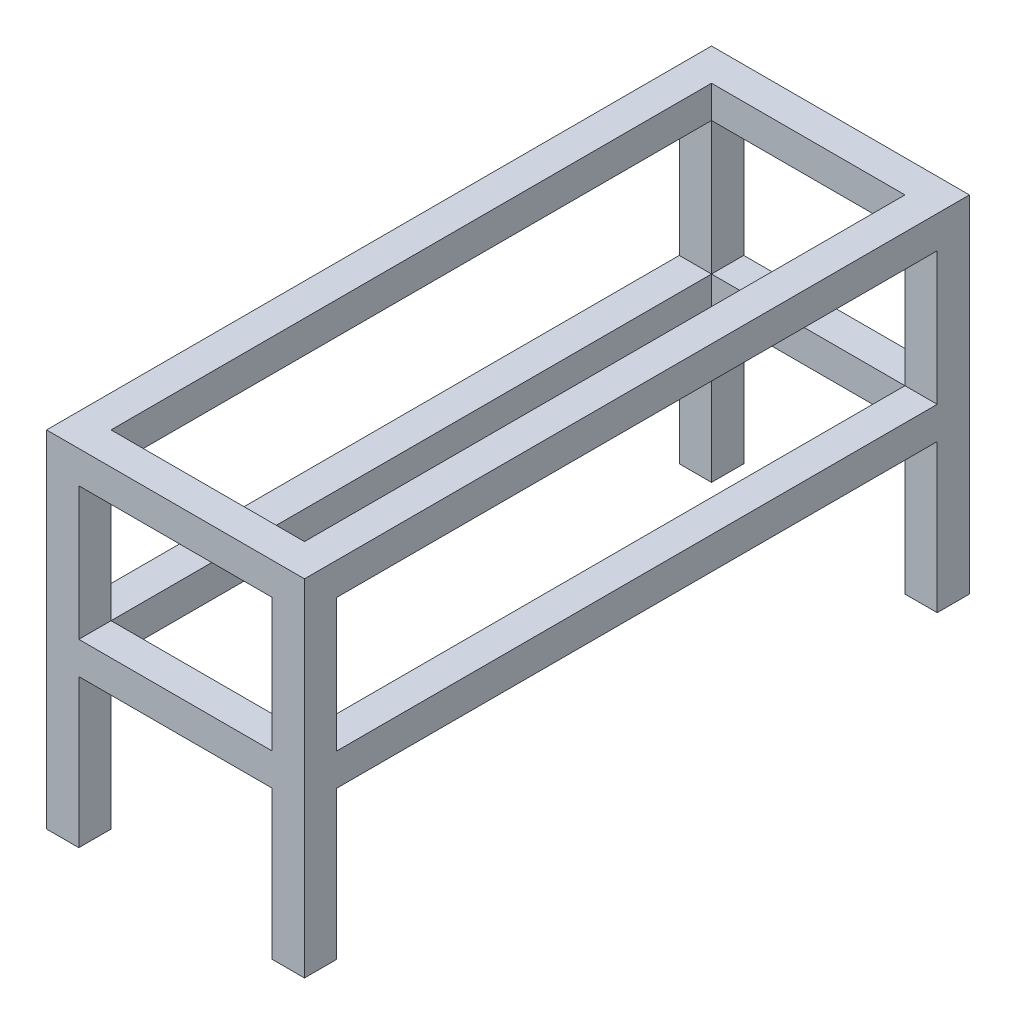
ISO-10303-21;
HEADER;
FILE_DESCRIPTION(('STEP AP214'),'2;1');
FILE_NAME('part.step','',(''),(''),'','','');
FILE_SCHEMA(('AUTOMOTIVE_DESIGN { 1 0 10303 214 1 1 1 1 }'));
ENDSEC;
DATA;
#1=APPLICATION_CONTEXT('core data for automotive mechanical design processes');
#2=APPLICATION_PROTOCOL_DEFINITION('international standard','automotive_design',2000,#1);
#3=PRODUCT_CONTEXT('',#1,'mechanical');
#4=PRODUCT('Part','Part','',(#3));
#5=PRODUCT_RELATED_PRODUCT_CATEGORY('part','',(#4));
#6=PRODUCT_DEFINITION_FORMATION('','',#4);
#7=PRODUCT_DEFINITION_CONTEXT('part definition',#1,'design');
#8=PRODUCT_DEFINITION('design','',#6,#7);
#9=PRODUCT_DEFINITION_SHAPE('','',#8);
#10=(LENGTH_UNIT() NAMED_UNIT(*) SI_UNIT(.MILLI.,.METRE.));
#11=(NAMED_UNIT(*) PLANE_ANGLE_UNIT() SI_UNIT($,.RADIAN.));
#12=(NAMED_UNIT(*) SI_UNIT($,.STERADIAN.) SOLID_ANGLE_UNIT());
#13=UNCERTAINTY_MEASURE_WITH_UNIT(LENGTH_MEASURE(1.E-05),#10,'distance_accuracy_value','');
#14=(GEOMETRIC_REPRESENTATION_CONTEXT(3) GLOBAL_UNCERTAINTY_ASSIGNED_CONTEXT((#13)) GLOBAL_UNIT_ASSIGNED_CONTEXT((#10,
#11,#12)) REPRESENTATION_CONTEXT('',''));
#15=CARTESIAN_POINT('',(0.,0.,0.));
#16=DIRECTION('',(0.,0.,1.));
#17=DIRECTION('',(1.,0.,0.));
#18=AXIS2_PLACEMENT_3D('',#15,#16,#17);
#19=CARTESIAN_POINT('',(0.,0.,-80.));
#20=DIRECTION('',(0.,0.,1.));
#21=DIRECTION('',(1.,0.,0.));
#22=AXIS2_PLACEMENT_3D('',#19,#20,#21);
#23=PLANE('',#22);
#24=DIRECTION('',(-1.,0.,0.));
#25=VECTOR('',#24,1.);
#26=CARTESIAN_POINT('',(80.0000000000001,-490.,-80.));
#27=LINE('',#26,#25);
#28=CARTESIAN_POINT('',(80.0000000000001,-490.,-80.));
#29=VERTEX_POINT('',#28);
#30=CARTESIAN_POINT('',(0.,-490.,-80.));
#31=VERTEX_POINT('',#30);
#32=EDGE_CURVE('E363',#29,#31,#27,.T.);
#33=ORIENTED_EDGE('',*,*,#32,.F.);
#34=DIRECTION('',(0.,1.,0.));
#35=VECTOR('',#34,1.);
#36=CARTESIAN_POINT('',(80.0000000000001,0.,-80.));
#37=LINE('',#36,#35);
#38=CARTESIAN_POINT('',(80.0000000000001,-857.801600000071,-80.));
#39=VERTEX_POINT('',#38);
#40=EDGE_CURVE('E432',#39,#29,#37,.T.);
#41=ORIENTED_EDGE('',*,*,#40,.F.);
#42=DIRECTION('',(1.,0.,0.));
#43=VECTOR('',#42,1.);
#44=CARTESIAN_POINT('',(0.,-857.801600000071,-80.));
#45=LINE('',#44,#43);
#46=CARTESIAN_POINT('',(1.05050398374356E-13,-857.801600000071,-80.));
#47=VERTEX_POINT('',#46);
#48=EDGE_CURVE('E429',#47,#39,#45,.T.);
#49=ORIENTED_EDGE('',*,*,#48,.F.);
#50=DIRECTION('',(0.,-1.,0.));
#51=VECTOR('',#50,1.);
#52=CARTESIAN_POINT('',(0.,0.,-80.));
#53=LINE('',#52,#51);
#54=EDGE_CURVE('E422',#31,#47,#53,.T.);
#55=ORIENTED_EDGE('',*,*,#54,.F.);
#56=EDGE_LOOP('',(#33,#41,#49,#55));
#57=FACE_BOUND('',#56,.T.);
#58=ADVANCED_FACE('F34',(#57),#23,.F.);
#59=DIRECTION('',(0.,-1.,0.));
#60=VECTOR('',#59,1.);
#61=CARTESIAN_POINT('',(80.0000000000001,-490.,-80.));
#62=LINE('',#61,#60);
#63=CARTESIAN_POINT('',(80.0000000000001,-410.,-80.));
#64=VERTEX_POINT('',#63);
#65=EDGE_CURVE('E360',#64,#29,#62,.T.);
#66=ORIENTED_EDGE('',*,*,#65,.F.);
#67=DIRECTION('',(1.,0.,0.));
#68=VECTOR('',#67,1.);
#69=CARTESIAN_POINT('',(0.,-410.,-80.));
#70=LINE('',#69,#68);
#71=CARTESIAN_POINT('',(560.,-410.,-80.));
#72=VERTEX_POINT('',#71);
#73=EDGE_CURVE('E446',#64,#72,#70,.T.);
#74=ORIENTED_EDGE('',*,*,#73,.T.);
#75=DIRECTION('',(0.,1.,0.));
#76=VECTOR('',#75,1.);
#77=CARTESIAN_POINT('',(560.,-410.,-80.));
#78=LINE('',#77,#76);
#79=CARTESIAN_POINT('',(560.,-490.,-80.));
#80=VERTEX_POINT('',#79);
#81=EDGE_CURVE('E375',#80,#72,#78,.T.);
#82=ORIENTED_EDGE('',*,*,#81,.F.);
#83=DIRECTION('',(1.,0.,0.));
#84=VECTOR('',#83,1.);
#85=CARTESIAN_POINT('',(0.,-490.,-80.));
#86=LINE('',#85,#84);
#87=EDGE_CURVE('E435',#29,#80,#86,.T.);
#88=ORIENTED_EDGE('',*,*,#87,.F.);
#89=EDGE_LOOP('',(#66,#74,#82,#88));
#90=FACE_BOUND('',#89,.T.);
#91=ADVANCED_FACE('F547',(#90),#23,.F.);
#92=DIRECTION('',(1.,0.,0.));
#93=VECTOR('',#92,1.);
#94=CARTESIAN_POINT('',(80.0000000000001,-410.,-80.));
#95=LINE('',#94,#93);
#96=CARTESIAN_POINT('',(0.,-410.,-80.));
#97=VERTEX_POINT('',#96);
#98=EDGE_CURVE('E365',#97,#64,#95,.T.);
#99=ORIENTED_EDGE('',*,*,#98,.F.);
#100=CARTESIAN_POINT('',(0.,-80.0000000000001,-80.));
#101=VERTEX_POINT('',#100);
#102=EDGE_CURVE('E426',#101,#97,#53,.T.);
#103=ORIENTED_EDGE('',*,*,#102,.F.);
#104=DIRECTION('',(-1.,0.,0.));
#105=VECTOR('',#104,1.);
#106=CARTESIAN_POINT('',(80.0000000000001,-80.0000000000001,-80.));
#107=LINE('',#106,#105);
#108=CARTESIAN_POINT('',(80.0000000000001,-80.0000000000001,-80.));
#109=VERTEX_POINT('',#108);
#110=EDGE_CURVE('E396',#109,#101,#107,.T.);
#111=ORIENTED_EDGE('',*,*,#110,.F.);
#112=EDGE_CURVE('E436',#64,#109,#37,.T.);
#113=ORIENTED_EDGE('',*,*,#112,.F.);
#114=EDGE_LOOP('',(#99,#103,#111,#113));
#115=FACE_BOUND('',#114,.T.);
#116=ADVANCED_FACE('F535',(#115),#23,.F.);
#117=DIRECTION('',(1.,0.,0.));
#118=VECTOR('',#117,1.);
#119=CARTESIAN_POINT('',(560.,-410.,-80.));
#120=LINE('',#119,#118);
#121=CARTESIAN_POINT('',(640.,-410.,-80.));
#122=VERTEX_POINT('',#121);
#123=EDGE_CURVE('E378',#72,#122,#120,.T.);
#124=ORIENTED_EDGE('',*,*,#123,.F.);
#125=DIRECTION('',(0.,1.,0.));
#126=VECTOR('',#125,1.);
#127=CARTESIAN_POINT('',(560.,0.,-80.));
#128=LINE('',#127,#126);
#129=CARTESIAN_POINT('',(560.,-80.,-80.));
#130=VERTEX_POINT('',#129);
#131=EDGE_CURVE('E443',#72,#130,#128,.T.);
#132=ORIENTED_EDGE('',*,*,#131,.T.);
#133=DIRECTION('',(-1.,0.,0.));
#134=VECTOR('',#133,1.);
#135=CARTESIAN_POINT('',(640.,-80.0000000000001,-80.));
#136=LINE('',#135,#134);
#137=CARTESIAN_POINT('',(640.,-80.0000000000001,-80.));
#138=VERTEX_POINT('',#137);
#139=EDGE_CURVE('E405',#138,#130,#136,.T.);
#140=ORIENTED_EDGE('',*,*,#139,.F.);
#141=DIRECTION('',(0.,-1.,0.));
#142=VECTOR('',#141,1.);
#143=CARTESIAN_POINT('',(640.,0.,-80.));
#144=LINE('',#143,#142);
#145=EDGE_CURVE('E60',#138,#122,#144,.T.);
#146=ORIENTED_EDGE('',*,*,#145,.T.);
#147=EDGE_LOOP('',(#124,#132,#140,#146));
#148=FACE_BOUND('',#147,.T.);
#149=ADVANCED_FACE('F472',(#148),#23,.F.);
#150=DIRECTION('',(-1.,0.,0.));
#151=VECTOR('',#150,1.);
#152=CARTESIAN_POINT('',(560.,-490.,-80.));
#153=LINE('',#152,#151);
#154=CARTESIAN_POINT('',(640.,-490.,-80.));
#155=VERTEX_POINT('',#154);
#156=EDGE_CURVE('E380',#155,#80,#153,.T.);
#157=ORIENTED_EDGE('',*,*,#156,.F.);
#158=CARTESIAN_POINT('',(640.,-857.801600000071,-80.));
#159=VERTEX_POINT('',#158);
#160=EDGE_CURVE('E38',#155,#159,#144,.T.);
#161=ORIENTED_EDGE('',*,*,#160,.T.);
#162=DIRECTION('',(-1.,0.,0.));
#163=VECTOR('',#162,1.);
#164=CARTESIAN_POINT('',(0.,-857.801600000071,-80.));
#165=LINE('',#164,#163);
#166=CARTESIAN_POINT('',(560.,-857.801600000071,-80.));
#167=VERTEX_POINT('',#166);
#168=EDGE_CURVE('E442',#159,#167,#165,.T.);
#169=ORIENTED_EDGE('',*,*,#168,.T.);
#170=EDGE_CURVE('E439',#167,#80,#128,.T.);
#171=ORIENTED_EDGE('',*,*,#170,.T.);
#172=EDGE_LOOP('',(#157,#161,#169,#171));
#173=FACE_BOUND('',#172,.T.);
#174=ADVANCED_FACE('F639',(#173),#23,.F.);
#175=DIRECTION('',(0.,-1.,0.));
#176=VECTOR('',#175,1.);
#177=CARTESIAN_POINT('',(80.0000000000001,-80.0000000000001,-80.));
#178=LINE('',#177,#176);
#179=CARTESIAN_POINT('',(80.0000000000001,0.,-80.));
#180=VERTEX_POINT('',#179);
#181=EDGE_CURVE('E393',#180,#109,#178,.T.);
#182=ORIENTED_EDGE('',*,*,#181,.F.);
#183=DIRECTION('',(1.,0.,0.));
#184=VECTOR('',#183,1.);
#185=CARTESIAN_POINT('',(0.,0.,-80.));
#186=LINE('',#185,#184);
#187=CARTESIAN_POINT('',(560.,0.,-80.));
#188=VERTEX_POINT('',#187);
#189=EDGE_CURVE('E421',#180,#188,#186,.T.);
#190=ORIENTED_EDGE('',*,*,#189,.T.);
#191=DIRECTION('',(0.,1.,0.));
#192=VECTOR('',#191,1.);
#193=CARTESIAN_POINT('',(560.,0.,-80.));
#194=LINE('',#193,#192);
#195=EDGE_CURVE('E411',#130,#188,#194,.T.);
#196=ORIENTED_EDGE('',*,*,#195,.F.);
#197=DIRECTION('',(-1.,0.,0.));
#198=VECTOR('',#197,1.);
#199=CARTESIAN_POINT('',(0.,-80.0000000000001,-80.));
#200=LINE('',#199,#198);
#201=EDGE_CURVE('E563',#130,#109,#200,.T.);
#202=ORIENTED_EDGE('',*,*,#201,.T.);
#203=EDGE_LOOP('',(#182,#190,#196,#202));
#204=FACE_BOUND('',#203,.T.);
#205=ADVANCED_FACE('F632',(#204),#23,.F.);
#206=CARTESIAN_POINT('',(0.,-410.,-80.));
#207=DIRECTION('',(0.,-1.,0.));
#208=DIRECTION('',(1.,0.,0.));
#209=AXIS2_PLACEMENT_3D('',#206,#207,#208);
#210=PLANE('',#209);
#211=DIRECTION('',(1.,0.,0.));
#212=VECTOR('',#211,1.);
#213=CARTESIAN_POINT('',(0.,-410.,0.));
#214=LINE('',#213,#212);
#215=CARTESIAN_POINT('',(80.0000000000001,-410.,0.));
#216=VERTEX_POINT('',#215);
#217=CARTESIAN_POINT('',(560.,-410.,0.));
#218=VERTEX_POINT('',#217);
#219=EDGE_CURVE('E586',#216,#218,#214,.T.);
#220=ORIENTED_EDGE('',*,*,#219,.T.);
#221=DIRECTION('',(0.,0.,1.));
#222=VECTOR('',#221,1.);
#223=CARTESIAN_POINT('',(560.,-410.,-80.));
#224=LINE('',#223,#222);
#225=EDGE_CURVE('E11',#72,#218,#224,.T.);
#226=ORIENTED_EDGE('',*,*,#225,.F.);
#227=ORIENTED_EDGE('',*,*,#73,.F.);
#228=DIRECTION('',(0.,0.,1.));
#229=VECTOR('',#228,1.);
#230=CARTESIAN_POINT('',(80.0000000000001,-410.,-80.));
#231=LINE('',#230,#229);
#232=EDGE_CURVE('E552',#64,#216,#231,.T.);
#233=ORIENTED_EDGE('',*,*,#232,.T.);
#234=EDGE_LOOP('',(#220,#226,#227,#233));
#235=FACE_BOUND('',#234,.T.);
#236=ADVANCED_FACE('F562',(#235),#210,.F.);
#237=CARTESIAN_POINT('',(560.,0.,-80.));
#238=DIRECTION('',(1.,0.,0.));
#239=DIRECTION('',(0.,0.,-1.));
#240=AXIS2_PLACEMENT_3D('',#237,#238,#239);
#241=PLANE('',#240);
#242=DIRECTION('',(0.,1.,0.));
#243=VECTOR('',#242,1.);
#244=CARTESIAN_POINT('',(560.,0.,0.));
#245=LINE('',#244,#243);
#246=CARTESIAN_POINT('',(560.,-80.,0.));
#247=VERTEX_POINT('',#246);
#248=EDGE_CURVE('E423',#218,#247,#245,.T.);
#249=ORIENTED_EDGE('',*,*,#248,.T.);
#250=DIRECTION('',(0.,0.,1.));
#251=VECTOR('',#250,1.);
#252=CARTESIAN_POINT('',(560.,-80.,-80.));
#253=LINE('',#252,#251);
#254=EDGE_CURVE('E44',#130,#247,#253,.T.);
#255=ORIENTED_EDGE('',*,*,#254,.F.);
#256=ORIENTED_EDGE('',*,*,#131,.F.);
#257=ORIENTED_EDGE('',*,*,#225,.T.);
#258=EDGE_LOOP('',(#249,#255,#256,#257));
#259=FACE_BOUND('',#258,.T.);
#260=ADVANCED_FACE('F644',(#259),#241,.F.);
#261=CARTESIAN_POINT('',(0.,-80.0000000000001,-80.));
#262=DIRECTION('',(0.,1.,0.));
#263=DIRECTION('',(-1.,0.,0.));
#264=AXIS2_PLACEMENT_3D('',#261,#262,#263);
#265=PLANE('',#264);
#266=DIRECTION('',(-1.,0.,0.));
#267=VECTOR('',#266,1.);
#268=CARTESIAN_POINT('',(0.,-80.0000000000001,0.));
#269=LINE('',#268,#267);
#270=CARTESIAN_POINT('',(80.0000000000001,-80.0000000000001,0.));
#271=VERTEX_POINT('',#270);
#272=EDGE_CURVE('E588',#247,#271,#269,.T.);
#273=ORIENTED_EDGE('',*,*,#272,.T.);
#274=DIRECTION('',(0.,0.,1.));
#275=VECTOR('',#274,1.);
#276=CARTESIAN_POINT('',(80.0000000000001,-80.0000000000001,-80.));
#277=LINE('',#276,#275);
#278=EDGE_CURVE('E559',#109,#271,#277,.T.);
#279=ORIENTED_EDGE('',*,*,#278,.F.);
#280=ORIENTED_EDGE('',*,*,#201,.F.);
#281=ORIENTED_EDGE('',*,*,#254,.T.);
#282=EDGE_LOOP('',(#273,#279,#280,#281));
#283=FACE_BOUND('',#282,.T.);
#284=ADVANCED_FACE('F672',(#283),#265,.F.);
#285=CARTESIAN_POINT('',(0.,0.,-80.));
#286=DIRECTION('',(0.,-1.,0.));
#287=DIRECTION('',(0.,0.,-1.));
#288=AXIS2_PLACEMENT_3D('',#285,#286,#287);
#289=PLANE('',#288);
#290=DIRECTION('',(0.,0.,1.));
#291=VECTOR('',#290,1.);
#292=CARTESIAN_POINT('',(640.,0.,-80.));
#293=LINE('',#292,#291);
#294=CARTESIAN_POINT('',(640.,0.,-1650.));
#295=VERTEX_POINT('',#294);
#296=CARTESIAN_POINT('',(640.,0.,0.));
#297=VERTEX_POINT('',#296);
#298=EDGE_CURVE('E560',#295,#297,#293,.T.);
#299=ORIENTED_EDGE('',*,*,#298,.F.);
#300=DIRECTION('',(1.,0.,0.));
#301=VECTOR('',#300,1.);
#302=CARTESIAN_POINT('',(0.,0.,-1650.));
#303=LINE('',#302,#301);
#304=CARTESIAN_POINT('',(0.,0.,-1650.));
#305=VERTEX_POINT('',#304);
#306=EDGE_CURVE('E285',#305,#295,#303,.T.);
#307=ORIENTED_EDGE('',*,*,#306,.F.);
#308=DIRECTION('',(0.,0.,1.));
#309=VECTOR('',#308,1.);
#310=CARTESIAN_POINT('',(0.,0.,-80.));
#311=LINE('',#310,#309);
#312=CARTESIAN_POINT('',(0.,0.,0.));
#313=VERTEX_POINT('',#312);
#314=EDGE_CURVE('E452',#305,#313,#311,.T.);
#315=ORIENTED_EDGE('',*,*,#314,.T.);
#316=DIRECTION('',(1.,0.,0.));
#317=VECTOR('',#316,1.);
#318=CARTESIAN_POINT('',(0.,0.,0.));
#319=LINE('',#318,#317);
#320=EDGE_CURVE('E459',#313,#297,#319,.T.);
#321=ORIENTED_EDGE('',*,*,#320,.T.);
#322=EDGE_LOOP('',(#299,#307,#315,#321));
#323=FACE_BOUND('',#322,.T.);
#324=DIRECTION('',(1.,0.,0.));
#325=VECTOR('',#324,1.);
#326=CARTESIAN_POINT('',(0.,0.,-1570.));
#327=LINE('',#326,#325);
#328=CARTESIAN_POINT('',(80.0000000000001,0.,-1570.));
#329=VERTEX_POINT('',#328);
#330=CARTESIAN_POINT('',(560.,0.,-1570.));
#331=VERTEX_POINT('',#330);
#332=EDGE_CURVE('E246',#329,#331,#327,.T.);
#333=ORIENTED_EDGE('',*,*,#332,.T.);
#334=DIRECTION('',(0.,0.,1.));
#335=VECTOR('',#334,1.);
#336=CARTESIAN_POINT('',(560.,0.,-825.));
#337=LINE('',#336,#335);
#338=EDGE_CURVE('E415',#331,#188,#337,.T.);
#339=ORIENTED_EDGE('',*,*,#338,.T.);
#340=ORIENTED_EDGE('',*,*,#189,.F.);
#341=DIRECTION('',(0.,0.,1.));
#342=VECTOR('',#341,1.);
#343=CARTESIAN_POINT('',(80.0000000000001,0.,-825.));
#344=LINE('',#343,#342);
#345=EDGE_CURVE('E399',#329,#180,#344,.T.);
#346=ORIENTED_EDGE('',*,*,#345,.F.);
#347=EDGE_LOOP('',(#333,#339,#340,#346));
#348=FACE_BOUND('',#347,.T.);
#349=ADVANCED_FACE('F36',(#323,#348),#289,.F.);
#350=CARTESIAN_POINT('',(640.,0.,-80.));
#351=DIRECTION('',(-1.,0.,0.));
#352=DIRECTION('',(0.,0.,1.));
#353=AXIS2_PLACEMENT_3D('',#350,#351,#352);
#354=PLANE('',#353);
#355=DIRECTION('',(0.,0.,1.));
#356=VECTOR('',#355,1.);
#357=CARTESIAN_POINT('',(640.,-80.0000000000001,-825.));
#358=LINE('',#357,#356);
#359=CARTESIAN_POINT('',(640.,-80.0000000000001,-1570.));
#360=VERTEX_POINT('',#359);
#361=EDGE_CURVE('E457',#360,#138,#358,.T.);
#362=ORIENTED_EDGE('',*,*,#361,.F.);
#363=DIRECTION('',(0.,-1.,0.));
#364=VECTOR('',#363,1.);
#365=CARTESIAN_POINT('',(640.,0.,-1570.));
#366=LINE('',#365,#364);
#367=CARTESIAN_POINT('',(640.,-410.,-1570.));
#368=VERTEX_POINT('',#367);
#369=EDGE_CURVE('E245',#360,#368,#366,.T.);
#370=ORIENTED_EDGE('',*,*,#369,.T.);
#371=DIRECTION('',(0.,0.,1.));
#372=VECTOR('',#371,1.);
#373=CARTESIAN_POINT('',(640.,-410.,-825.));
#374=LINE('',#373,#372);
#375=EDGE_CURVE('E387',#368,#122,#374,.T.);
#376=ORIENTED_EDGE('',*,*,#375,.T.);
#377=ORIENTED_EDGE('',*,*,#145,.F.);
#378=EDGE_LOOP('',(#362,#370,#376,#377));
#379=FACE_BOUND('',#378,.T.);
#380=DIRECTION('',(0.,-1.,0.));
#381=VECTOR('',#380,1.);
#382=CARTESIAN_POINT('',(640.,0.,0.));
#383=LINE('',#382,#381);
#384=CARTESIAN_POINT('',(640.,-857.801600000071,0.));
#385=VERTEX_POINT('',#384);
#386=EDGE_CURVE('E584',#297,#385,#383,.T.);
#387=ORIENTED_EDGE('',*,*,#386,.T.);
#388=DIRECTION('',(0.,0.,1.));
#389=VECTOR('',#388,1.);
#390=CARTESIAN_POINT('',(640.,-857.801600000071,-80.));
#391=LINE('',#390,#389);
#392=EDGE_CURVE('E596',#159,#385,#391,.T.);
#393=ORIENTED_EDGE('',*,*,#392,.F.);
#394=ORIENTED_EDGE('',*,*,#160,.F.);
#395=DIRECTION('',(0.,0.,1.));
#396=VECTOR('',#395,1.);
#397=CARTESIAN_POINT('',(640.,-490.,-825.));
#398=LINE('',#397,#396);
#399=CARTESIAN_POINT('',(640.,-490.,-1570.));
#400=VERTEX_POINT('',#399);
#401=EDGE_CURVE('E241',#400,#155,#398,.T.);
#402=ORIENTED_EDGE('',*,*,#401,.F.);
#403=CARTESIAN_POINT('',(640.,-857.801600000071,-1570.));
#404=VERTEX_POINT('',#403);
#405=EDGE_CURVE('E234',#400,#404,#366,.T.);
#406=ORIENTED_EDGE('',*,*,#405,.T.);
#407=DIRECTION('',(0.,0.,-1.));
#408=VECTOR('',#407,1.);
#409=CARTESIAN_POINT('',(640.,-857.801600000071,-1570.));
#410=LINE('',#409,#408);
#411=CARTESIAN_POINT('',(640.,-857.801600000071,-1650.));
#412=VERTEX_POINT('',#411);
#413=EDGE_CURVE('E238',#404,#412,#410,.T.);
#414=ORIENTED_EDGE('',*,*,#413,.T.);
#415=DIRECTION('',(0.,-1.,0.));
#416=VECTOR('',#415,1.);
#417=CARTESIAN_POINT('',(640.,0.,-1650.));
#418=LINE('',#417,#416);
#419=EDGE_CURVE('E288',#295,#412,#418,.T.);
#420=ORIENTED_EDGE('',*,*,#419,.F.);
#421=ORIENTED_EDGE('',*,*,#298,.T.);
#422=EDGE_LOOP('',(#387,#393,#394,#402,#406,#414,#420,#421));
#423=FACE_BOUND('',#422,.T.);
#424=ADVANCED_FACE('F236',(#379,#423),#354,.F.);
#425=CARTESIAN_POINT('',(0.,-857.801600000071,-80.));
#426=DIRECTION('',(0.,1.,0.));
#427=DIRECTION('',(0.,0.,1.));
#428=AXIS2_PLACEMENT_3D('',#425,#426,#427);
#429=PLANE('',#428);
#430=DIRECTION('',(-1.,0.,0.));
#431=VECTOR('',#430,1.);
#432=CARTESIAN_POINT('',(0.,-857.801600000071,0.));
#433=LINE('',#432,#431);
#434=CARTESIAN_POINT('',(560.,-857.801600000071,0.));
#435=VERTEX_POINT('',#434);
#436=EDGE_CURVE('E582',#385,#435,#433,.T.);
#437=ORIENTED_EDGE('',*,*,#436,.T.);
#438=DIRECTION('',(0.,0.,1.));
#439=VECTOR('',#438,1.);
#440=CARTESIAN_POINT('',(560.,-857.801600000071,-80.));
#441=LINE('',#440,#439);
#442=EDGE_CURVE('E599',#167,#435,#441,.T.);
#443=ORIENTED_EDGE('',*,*,#442,.F.);
#444=ORIENTED_EDGE('',*,*,#168,.F.);
#445=ORIENTED_EDGE('',*,*,#392,.T.);
#446=EDGE_LOOP('',(#437,#443,#444,#445));
#447=FACE_BOUND('',#446,.T.);
#448=ADVANCED_FACE('F680',(#447),#429,.F.);
#449=CARTESIAN_POINT('',(560.,-490.,0.));
#450=VERTEX_POINT('',#449);
#451=EDGE_CURVE('E579',#435,#450,#245,.T.);
#452=ORIENTED_EDGE('',*,*,#451,.T.);
#453=DIRECTION('',(0.,0.,1.));
#454=VECTOR('',#453,1.);
#455=CARTESIAN_POINT('',(560.,-490.,-80.));
#456=LINE('',#455,#454);
#457=EDGE_CURVE('E602',#80,#450,#456,.T.);
#458=ORIENTED_EDGE('',*,*,#457,.F.);
#459=ORIENTED_EDGE('',*,*,#170,.F.);
#460=ORIENTED_EDGE('',*,*,#442,.T.);
#461=EDGE_LOOP('',(#452,#458,#459,#460));
#462=FACE_BOUND('',#461,.T.);
#463=ADVANCED_FACE('F674',(#462),#241,.F.);
#464=CARTESIAN_POINT('',(0.,-490.,-80.));
#465=DIRECTION('',(0.,-1.,0.));
#466=DIRECTION('',(1.,0.,0.));
#467=AXIS2_PLACEMENT_3D('',#464,#465,#466);
#468=PLANE('',#467);
#469=DIRECTION('',(1.,0.,0.));
#470=VECTOR('',#469,1.);
#471=CARTESIAN_POINT('',(0.,-490.,0.));
#472=LINE('',#471,#470);
#473=CARTESIAN_POINT('',(80.0000000000001,-490.,0.));
#474=VERTEX_POINT('',#473);
#475=EDGE_CURVE('E576',#474,#450,#472,.T.);
#476=ORIENTED_EDGE('',*,*,#475,.F.);
#477=DIRECTION('',(0.,0.,1.));
#478=VECTOR('',#477,1.);
#479=CARTESIAN_POINT('',(80.0000000000001,-490.,-80.));
#480=LINE('',#479,#478);
#481=EDGE_CURVE('E604',#29,#474,#480,.T.);
#482=ORIENTED_EDGE('',*,*,#481,.F.);
#483=ORIENTED_EDGE('',*,*,#87,.T.);
#484=ORIENTED_EDGE('',*,*,#457,.T.);
#485=EDGE_LOOP('',(#476,#482,#483,#484));
#486=FACE_BOUND('',#485,.T.);
#487=ADVANCED_FACE('F684',(#486),#468,.T.);
#488=CARTESIAN_POINT('',(80.0000000000001,0.,-80.));
#489=DIRECTION('',(1.,0.,0.));
#490=DIRECTION('',(0.,0.,-1.));
#491=AXIS2_PLACEMENT_3D('',#488,#489,#490);
#492=PLANE('',#491);
#493=DIRECTION('',(0.,1.,0.));
#494=VECTOR('',#493,1.);
#495=CARTESIAN_POINT('',(80.0000000000001,0.,0.));
#496=LINE('',#495,#494);
#497=CARTESIAN_POINT('',(80.0000000000001,-857.801600000071,0.));
#498=VERTEX_POINT('',#497);
#499=EDGE_CURVE('E573',#498,#474,#496,.T.);
#500=ORIENTED_EDGE('',*,*,#499,.F.);
#501=DIRECTION('',(0.,0.,1.));
#502=VECTOR('',#501,1.);
#503=CARTESIAN_POINT('',(80.0000000000001,-857.801600000071,-80.));
#504=LINE('',#503,#502);
#505=EDGE_CURVE('E606',#39,#498,#504,.T.);
#506=ORIENTED_EDGE('',*,*,#505,.F.);
#507=ORIENTED_EDGE('',*,*,#40,.T.);
#508=ORIENTED_EDGE('',*,*,#481,.T.);
#509=EDGE_LOOP('',(#500,#506,#507,#508));
#510=FACE_BOUND('',#509,.T.);
#511=ADVANCED_FACE('F626',(#510),#492,.T.);
#512=CARTESIAN_POINT('',(0.,-857.801600000071,-80.));
#513=DIRECTION('',(0.,-1.,0.));
#514=DIRECTION('',(0.,0.,-1.));
#515=AXIS2_PLACEMENT_3D('',#512,#513,#514);
#516=PLANE('',#515);
#517=DIRECTION('',(1.,0.,0.));
#518=VECTOR('',#517,1.);
#519=CARTESIAN_POINT('',(0.,-857.801600000071,0.));
#520=LINE('',#519,#518);
#521=CARTESIAN_POINT('',(1.05050398374356E-13,-857.801600000071,0.));
#522=VERTEX_POINT('',#521);
#523=EDGE_CURVE('E570',#522,#498,#520,.T.);
#524=ORIENTED_EDGE('',*,*,#523,.F.);
#525=DIRECTION('',(0.,0.,1.));
#526=VECTOR('',#525,1.);
#527=CARTESIAN_POINT('',(1.05050398374356E-13,-857.801600000071,-80.));
#528=LINE('',#527,#526);
#529=EDGE_CURVE('E607',#47,#522,#528,.T.);
#530=ORIENTED_EDGE('',*,*,#529,.F.);
#531=ORIENTED_EDGE('',*,*,#48,.T.);
#532=ORIENTED_EDGE('',*,*,#505,.T.);
#533=EDGE_LOOP('',(#524,#530,#531,#532));
#534=FACE_BOUND('',#533,.T.);
#535=ADVANCED_FACE('F620',(#534),#516,.T.);
#536=CARTESIAN_POINT('',(0.,0.,-80.));
#537=DIRECTION('',(-1.,0.,0.));
#538=DIRECTION('',(0.,-1.,0.));
#539=AXIS2_PLACEMENT_3D('',#536,#537,#538);
#540=PLANE('',#539);
#541=ORIENTED_EDGE('',*,*,#314,.F.);
#542=DIRECTION('',(0.,-1.,0.));
#543=VECTOR('',#542,1.);
#544=CARTESIAN_POINT('',(0.,0.,-1650.));
#545=LINE('',#544,#543);
#546=CARTESIAN_POINT('',(1.05050398374356E-13,-857.801600000071,-1650.));
#547=VERTEX_POINT('',#546);
#548=EDGE_CURVE('E303',#305,#547,#545,.T.);
#549=ORIENTED_EDGE('',*,*,#548,.T.);
#550=DIRECTION('',(0.,0.,-1.));
#551=VECTOR('',#550,1.);
#552=CARTESIAN_POINT('',(1.05050398374356E-13,-857.801600000071,-1570.));
#553=LINE('',#552,#551);
#554=CARTESIAN_POINT('',(1.05050398374356E-13,-857.801600000071,-1570.));
#555=VERTEX_POINT('',#554);
#556=EDGE_CURVE('E320',#555,#547,#553,.T.);
#557=ORIENTED_EDGE('',*,*,#556,.F.);
#558=DIRECTION('',(0.,-1.,0.));
#559=VECTOR('',#558,1.);
#560=CARTESIAN_POINT('',(0.,0.,-1570.));
#561=LINE('',#560,#559);
#562=CARTESIAN_POINT('',(0.,-490.,-1570.));
#563=VERTEX_POINT('',#562);
#564=EDGE_CURVE('E276',#563,#555,#561,.T.);
#565=ORIENTED_EDGE('',*,*,#564,.F.);
#566=DIRECTION('',(0.,0.,1.));
#567=VECTOR('',#566,1.);
#568=CARTESIAN_POINT('',(0.,-490.,-825.));
#569=LINE('',#568,#567);
#570=EDGE_CURVE('E52',#563,#31,#569,.T.);
#571=ORIENTED_EDGE('',*,*,#570,.T.);
#572=ORIENTED_EDGE('',*,*,#54,.T.);
#573=ORIENTED_EDGE('',*,*,#529,.T.);
#574=DIRECTION('',(0.,-1.,0.));
#575=VECTOR('',#574,1.);
#576=CARTESIAN_POINT('',(0.,0.,0.));
#577=LINE('',#576,#575);
#578=EDGE_CURVE('E463',#313,#522,#577,.T.);
#579=ORIENTED_EDGE('',*,*,#578,.F.);
#580=EDGE_LOOP('',(#541,#549,#557,#565,#571,#572,#573,#579));
#581=FACE_BOUND('',#580,.T.);
#582=CARTESIAN_POINT('',(0.,-80.0000000000001,-1570.));
#583=VERTEX_POINT('',#582);
#584=CARTESIAN_POINT('',(0.,-410.,-1570.));
#585=VERTEX_POINT('',#584);
#586=EDGE_CURVE('E278',#583,#585,#561,.T.);
#587=ORIENTED_EDGE('',*,*,#586,.F.);
#588=DIRECTION('',(0.,0.,1.));
#589=VECTOR('',#588,1.);
#590=CARTESIAN_POINT('',(0.,-80.0000000000001,-825.));
#591=LINE('',#590,#589);
#592=EDGE_CURVE('E401',#583,#101,#591,.T.);
#593=ORIENTED_EDGE('',*,*,#592,.T.);
#594=ORIENTED_EDGE('',*,*,#102,.T.);
#595=DIRECTION('',(0.,0.,1.));
#596=VECTOR('',#595,1.);
#597=CARTESIAN_POINT('',(0.,-410.,-825.));
#598=LINE('',#597,#596);
#599=EDGE_CURVE('E370',#585,#97,#598,.T.);
#600=ORIENTED_EDGE('',*,*,#599,.F.);
#601=EDGE_LOOP('',(#587,#593,#594,#600));
#602=FACE_BOUND('',#601,.T.);
#603=ADVANCED_FACE('F531',(#581,#602),#540,.T.);
#604=EDGE_CURVE('E555',#216,#271,#496,.T.);
#605=ORIENTED_EDGE('',*,*,#604,.F.);
#606=ORIENTED_EDGE('',*,*,#232,.F.);
#607=ORIENTED_EDGE('',*,*,#112,.T.);
#608=ORIENTED_EDGE('',*,*,#278,.T.);
#609=EDGE_LOOP('',(#605,#606,#607,#608));
#610=FACE_BOUND('',#609,.T.);
#611=ADVANCED_FACE('F553',(#610),#492,.T.);
#612=CARTESIAN_POINT('',(0.,0.,0.));
#613=DIRECTION('',(0.,0.,1.));
#614=DIRECTION('',(1.,0.,0.));
#615=AXIS2_PLACEMENT_3D('',#612,#613,#614);
#616=PLANE('',#615);
#617=ORIENTED_EDGE('',*,*,#320,.F.);
#618=ORIENTED_EDGE('',*,*,#578,.T.);
#619=ORIENTED_EDGE('',*,*,#523,.T.);
#620=ORIENTED_EDGE('',*,*,#499,.T.);
#621=ORIENTED_EDGE('',*,*,#475,.T.);
#622=ORIENTED_EDGE('',*,*,#451,.F.);
#623=ORIENTED_EDGE('',*,*,#436,.F.);
#624=ORIENTED_EDGE('',*,*,#386,.F.);
#625=EDGE_LOOP('',(#617,#618,#619,#620,#621,#622,#623,#624));
#626=FACE_BOUND('',#625,.T.);
#627=ORIENTED_EDGE('',*,*,#219,.F.);
#628=ORIENTED_EDGE('',*,*,#604,.T.);
#629=ORIENTED_EDGE('',*,*,#272,.F.);
#630=ORIENTED_EDGE('',*,*,#248,.F.);
#631=EDGE_LOOP('',(#627,#628,#629,#630));
#632=FACE_BOUND('',#631,.T.);
#633=ADVANCED_FACE('F616',(#626,#632),#616,.T.);
#634=CARTESIAN_POINT('',(640.,-80.0000000000001,-825.));
#635=DIRECTION('',(0.,1.,0.));
#636=DIRECTION('',(-1.,0.,0.));
#637=AXIS2_PLACEMENT_3D('',#634,#635,#636);
#638=PLANE('',#637);
#639=ORIENTED_EDGE('',*,*,#139,.T.);
#640=DIRECTION('',(0.,0.,1.));
#641=VECTOR('',#640,1.);
#642=CARTESIAN_POINT('',(560.,-80.,-825.));
#643=LINE('',#642,#641);
#644=CARTESIAN_POINT('',(560.,-80.,-1570.));
#645=VERTEX_POINT('',#644);
#646=EDGE_CURVE('E408',#645,#130,#643,.T.);
#647=ORIENTED_EDGE('',*,*,#646,.F.);
#648=DIRECTION('',(-1.,0.,0.));
#649=VECTOR('',#648,1.);
#650=CARTESIAN_POINT('',(640.,-80.0000000000001,-1570.));
#651=LINE('',#650,#649);
#652=EDGE_CURVE('E357',#360,#645,#651,.T.);
#653=ORIENTED_EDGE('',*,*,#652,.F.);
#654=ORIENTED_EDGE('',*,*,#361,.T.);
#655=EDGE_LOOP('',(#639,#647,#653,#654));
#656=FACE_BOUND('',#655,.T.);
#657=ADVANCED_FACE('F470',(#656),#638,.F.);
#658=CARTESIAN_POINT('',(560.,0.,-825.));
#659=DIRECTION('',(1.,0.,0.));
#660=DIRECTION('',(0.,0.,-1.));
#661=AXIS2_PLACEMENT_3D('',#658,#659,#660);
#662=PLANE('',#661);
#663=ORIENTED_EDGE('',*,*,#195,.T.);
#664=ORIENTED_EDGE('',*,*,#338,.F.);
#665=DIRECTION('',(0.,1.,0.));
#666=VECTOR('',#665,1.);
#667=CARTESIAN_POINT('',(560.,0.,-1570.));
#668=LINE('',#667,#666);
#669=EDGE_CURVE('E354',#645,#331,#668,.T.);
#670=ORIENTED_EDGE('',*,*,#669,.F.);
#671=ORIENTED_EDGE('',*,*,#646,.T.);
#672=EDGE_LOOP('',(#663,#664,#670,#671));
#673=FACE_BOUND('',#672,.T.);
#674=ADVANCED_FACE('F468',(#673),#662,.F.);
#675=CARTESIAN_POINT('',(80.0000000000001,-80.0000000000001,-825.));
#676=DIRECTION('',(-1.,0.,0.));
#677=DIRECTION('',(0.,0.,1.));
#678=AXIS2_PLACEMENT_3D('',#675,#676,#677);
#679=PLANE('',#678);
#680=ORIENTED_EDGE('',*,*,#181,.T.);
#681=DIRECTION('',(0.,0.,1.));
#682=VECTOR('',#681,1.);
#683=CARTESIAN_POINT('',(80.0000000000001,-80.0000000000001,-825.));
#684=LINE('',#683,#682);
#685=CARTESIAN_POINT('',(80.0000000000001,-80.0000000000001,-1570.));
#686=VERTEX_POINT('',#685);
#687=EDGE_CURVE('E403',#686,#109,#684,.T.);
#688=ORIENTED_EDGE('',*,*,#687,.F.);
#689=DIRECTION('',(0.,-1.,0.));
#690=VECTOR('',#689,1.);
#691=CARTESIAN_POINT('',(80.0000000000001,-80.0000000000001,-1570.));
#692=LINE('',#691,#690);
#693=EDGE_CURVE('E348',#329,#686,#692,.T.);
#694=ORIENTED_EDGE('',*,*,#693,.F.);
#695=ORIENTED_EDGE('',*,*,#345,.T.);
#696=EDGE_LOOP('',(#680,#688,#694,#695));
#697=FACE_BOUND('',#696,.T.);
#698=ADVANCED_FACE('F648',(#697),#679,.F.);
#699=CARTESIAN_POINT('',(80.0000000000001,-80.0000000000001,-825.));
#700=DIRECTION('',(0.,1.,0.));
#701=DIRECTION('',(0.,0.,1.));
#702=AXIS2_PLACEMENT_3D('',#699,#700,#701);
#703=PLANE('',#702);
#704=ORIENTED_EDGE('',*,*,#110,.T.);
#705=ORIENTED_EDGE('',*,*,#592,.F.);
#706=DIRECTION('',(-1.,0.,0.));
#707=VECTOR('',#706,1.);
#708=CARTESIAN_POINT('',(80.0000000000001,-80.0000000000001,-1570.));
#709=LINE('',#708,#707);
#710=EDGE_CURVE('E351',#686,#583,#709,.T.);
#711=ORIENTED_EDGE('',*,*,#710,.F.);
#712=ORIENTED_EDGE('',*,*,#687,.T.);
#713=EDGE_LOOP('',(#704,#705,#711,#712));
#714=FACE_BOUND('',#713,.T.);
#715=ADVANCED_FACE('F650',(#714),#703,.F.);
#716=CARTESIAN_POINT('',(560.,-410.,-825.));
#717=DIRECTION('',(1.,0.,0.));
#718=DIRECTION('',(0.,0.,-1.));
#719=AXIS2_PLACEMENT_3D('',#716,#717,#718);
#720=PLANE('',#719);
#721=ORIENTED_EDGE('',*,*,#81,.T.);
#722=DIRECTION('',(0.,0.,1.));
#723=VECTOR('',#722,1.);
#724=CARTESIAN_POINT('',(560.,-410.,-825.));
#725=LINE('',#724,#723);
#726=CARTESIAN_POINT('',(560.,-410.,-1570.));
#727=VERTEX_POINT('',#726);
#728=EDGE_CURVE('E390',#727,#72,#725,.T.);
#729=ORIENTED_EDGE('',*,*,#728,.F.);
#730=DIRECTION('',(0.,1.,0.));
#731=VECTOR('',#730,1.);
#732=CARTESIAN_POINT('',(560.,-410.,-1570.));
#733=LINE('',#732,#731);
#734=CARTESIAN_POINT('',(560.,-490.,-1570.));
#735=VERTEX_POINT('',#734);
#736=EDGE_CURVE('E340',#735,#727,#733,.T.);
#737=ORIENTED_EDGE('',*,*,#736,.F.);
#738=DIRECTION('',(0.,0.,1.));
#739=VECTOR('',#738,1.);
#740=CARTESIAN_POINT('',(560.,-490.,-825.));
#741=LINE('',#740,#739);
#742=EDGE_CURVE('E383',#735,#80,#741,.T.);
#743=ORIENTED_EDGE('',*,*,#742,.T.);
#744=EDGE_LOOP('',(#721,#729,#737,#743));
#745=FACE_BOUND('',#744,.T.);
#746=ADVANCED_FACE('F652',(#745),#720,.F.);
#747=CARTESIAN_POINT('',(560.,-410.,-825.));
#748=DIRECTION('',(0.,-1.,0.));
#749=DIRECTION('',(0.,0.,-1.));
#750=AXIS2_PLACEMENT_3D('',#747,#748,#749);
#751=PLANE('',#750);
#752=ORIENTED_EDGE('',*,*,#123,.T.);
#753=ORIENTED_EDGE('',*,*,#375,.F.);
#754=DIRECTION('',(1.,0.,0.));
#755=VECTOR('',#754,1.);
#756=CARTESIAN_POINT('',(560.,-410.,-1570.));
#757=LINE('',#756,#755);
#758=EDGE_CURVE('E345',#727,#368,#757,.T.);
#759=ORIENTED_EDGE('',*,*,#758,.F.);
#760=ORIENTED_EDGE('',*,*,#728,.T.);
#761=EDGE_LOOP('',(#752,#753,#759,#760));
#762=FACE_BOUND('',#761,.T.);
#763=ADVANCED_FACE('F478',(#762),#751,.F.);
#764=CARTESIAN_POINT('',(560.,-490.,-825.));
#765=DIRECTION('',(0.,1.,0.));
#766=DIRECTION('',(0.,0.,1.));
#767=AXIS2_PLACEMENT_3D('',#764,#765,#766);
#768=PLANE('',#767);
#769=ORIENTED_EDGE('',*,*,#156,.T.);
#770=ORIENTED_EDGE('',*,*,#742,.F.);
#771=DIRECTION('',(-1.,0.,0.));
#772=VECTOR('',#771,1.);
#773=CARTESIAN_POINT('',(560.,-490.,-1570.));
#774=LINE('',#773,#772);
#775=EDGE_CURVE('E343',#400,#735,#774,.T.);
#776=ORIENTED_EDGE('',*,*,#775,.F.);
#777=ORIENTED_EDGE('',*,*,#401,.T.);
#778=EDGE_LOOP('',(#769,#770,#776,#777));
#779=FACE_BOUND('',#778,.T.);
#780=ADVANCED_FACE('F730',(#779),#768,.F.);
#781=CARTESIAN_POINT('',(80.0000000000001,-490.,-825.));
#782=DIRECTION('',(-1.,0.,0.));
#783=DIRECTION('',(0.,0.,1.));
#784=AXIS2_PLACEMENT_3D('',#781,#782,#783);
#785=PLANE('',#784);
#786=ORIENTED_EDGE('',*,*,#65,.T.);
#787=DIRECTION('',(0.,0.,1.));
#788=VECTOR('',#787,1.);
#789=CARTESIAN_POINT('',(80.0000000000001,-490.,-825.));
#790=LINE('',#789,#788);
#791=CARTESIAN_POINT('',(80.0000000000001,-490.,-1570.));
#792=VERTEX_POINT('',#791);
#793=EDGE_CURVE('E373',#792,#29,#790,.T.);
#794=ORIENTED_EDGE('',*,*,#793,.F.);
#795=DIRECTION('',(0.,-1.,0.));
#796=VECTOR('',#795,1.);
#797=CARTESIAN_POINT('',(80.0000000000001,-490.,-1570.));
#798=LINE('',#797,#796);
#799=CARTESIAN_POINT('',(80.0000000000001,-410.,-1570.));
#800=VERTEX_POINT('',#799);
#801=EDGE_CURVE('E313',#800,#792,#798,.T.);
#802=ORIENTED_EDGE('',*,*,#801,.F.);
#803=DIRECTION('',(0.,0.,1.));
#804=VECTOR('',#803,1.);
#805=CARTESIAN_POINT('',(80.0000000000001,-410.,-825.));
#806=LINE('',#805,#804);
#807=EDGE_CURVE('E367',#800,#64,#806,.T.);
#808=ORIENTED_EDGE('',*,*,#807,.T.);
#809=EDGE_LOOP('',(#786,#794,#802,#808));
#810=FACE_BOUND('',#809,.T.);
#811=ADVANCED_FACE('F541',(#810),#785,.F.);
#812=CARTESIAN_POINT('',(80.0000000000001,-490.,-825.));
#813=DIRECTION('',(0.,1.,0.));
#814=DIRECTION('',(0.,0.,1.));
#815=AXIS2_PLACEMENT_3D('',#812,#813,#814);
#816=PLANE('',#815);
#817=ORIENTED_EDGE('',*,*,#32,.T.);
#818=ORIENTED_EDGE('',*,*,#570,.F.);
#819=DIRECTION('',(-1.,0.,0.));
#820=VECTOR('',#819,1.);
#821=CARTESIAN_POINT('',(80.0000000000001,-490.,-1570.));
#822=LINE('',#821,#820);
#823=EDGE_CURVE('E337',#792,#563,#822,.T.);
#824=ORIENTED_EDGE('',*,*,#823,.F.);
#825=ORIENTED_EDGE('',*,*,#793,.T.);
#826=EDGE_LOOP('',(#817,#818,#824,#825));
#827=FACE_BOUND('',#826,.T.);
#828=ADVANCED_FACE('F702',(#827),#816,.F.);
#829=CARTESIAN_POINT('',(80.0000000000001,-410.,-825.));
#830=DIRECTION('',(0.,-1.,0.));
#831=DIRECTION('',(0.,0.,-1.));
#832=AXIS2_PLACEMENT_3D('',#829,#830,#831);
#833=PLANE('',#832);
#834=ORIENTED_EDGE('',*,*,#98,.T.);
#835=ORIENTED_EDGE('',*,*,#807,.F.);
#836=DIRECTION('',(1.,0.,0.));
#837=VECTOR('',#836,1.);
#838=CARTESIAN_POINT('',(80.0000000000001,-410.,-1570.));
#839=LINE('',#838,#837);
#840=EDGE_CURVE('E334',#585,#800,#839,.T.);
#841=ORIENTED_EDGE('',*,*,#840,.F.);
#842=ORIENTED_EDGE('',*,*,#599,.T.);
#843=EDGE_LOOP('',(#834,#835,#841,#842));
#844=FACE_BOUND('',#843,.T.);
#845=ADVANCED_FACE('F528',(#844),#833,.F.);
#846=CARTESIAN_POINT('',(0.,0.,-1570.));
#847=DIRECTION('',(0.,0.,-1.));
#848=DIRECTION('',(1.,0.,0.));
#849=AXIS2_PLACEMENT_3D('',#846,#847,#848);
#850=PLANE('',#849);
#851=ORIENTED_EDGE('',*,*,#369,.F.);
#852=ORIENTED_EDGE('',*,*,#652,.T.);
#853=DIRECTION('',(0.,1.,0.));
#854=VECTOR('',#853,1.);
#855=CARTESIAN_POINT('',(560.,0.,-1570.));
#856=LINE('',#855,#854);
#857=EDGE_CURVE('E265',#727,#645,#856,.T.);
#858=ORIENTED_EDGE('',*,*,#857,.F.);
#859=ORIENTED_EDGE('',*,*,#758,.T.);
#860=EDGE_LOOP('',(#851,#852,#858,#859));
#861=FACE_BOUND('',#860,.T.);
#862=ADVANCED_FACE('F481',(#861),#850,.F.);
#863=DIRECTION('',(-1.,0.,0.));
#864=VECTOR('',#863,1.);
#865=CARTESIAN_POINT('',(0.,-80.0000000000001,-1570.));
#866=LINE('',#865,#864);
#867=EDGE_CURVE('E282',#645,#686,#866,.T.);
#868=ORIENTED_EDGE('',*,*,#867,.F.);
#869=ORIENTED_EDGE('',*,*,#669,.T.);
#870=ORIENTED_EDGE('',*,*,#332,.F.);
#871=ORIENTED_EDGE('',*,*,#693,.T.);
#872=EDGE_LOOP('',(#868,#869,#870,#871));
#873=FACE_BOUND('',#872,.T.);
#874=ADVANCED_FACE('F516',(#873),#850,.F.);
#875=DIRECTION('',(0.,1.,0.));
#876=VECTOR('',#875,1.);
#877=CARTESIAN_POINT('',(80.0000000000001,0.,-1570.));
#878=LINE('',#877,#876);
#879=EDGE_CURVE('E256',#800,#686,#878,.T.);
#880=ORIENTED_EDGE('',*,*,#879,.T.);
#881=ORIENTED_EDGE('',*,*,#710,.T.);
#882=ORIENTED_EDGE('',*,*,#586,.T.);
#883=ORIENTED_EDGE('',*,*,#840,.T.);
#884=EDGE_LOOP('',(#880,#881,#882,#883));
#885=FACE_BOUND('',#884,.T.);
#886=ADVANCED_FACE('F522',(#885),#850,.F.);
#887=DIRECTION('',(1.,0.,0.));
#888=VECTOR('',#887,1.);
#889=CARTESIAN_POINT('',(0.,-490.,-1570.));
#890=LINE('',#889,#888);
#891=EDGE_CURVE('E263',#792,#735,#890,.T.);
#892=ORIENTED_EDGE('',*,*,#891,.T.);
#893=ORIENTED_EDGE('',*,*,#736,.T.);
#894=DIRECTION('',(1.,0.,0.));
#895=VECTOR('',#894,1.);
#896=CARTESIAN_POINT('',(0.,-410.,-1570.));
#897=LINE('',#896,#895);
#898=EDGE_CURVE('E279',#800,#727,#897,.T.);
#899=ORIENTED_EDGE('',*,*,#898,.F.);
#900=ORIENTED_EDGE('',*,*,#801,.T.);
#901=EDGE_LOOP('',(#892,#893,#899,#900));
#902=FACE_BOUND('',#901,.T.);
#903=ADVANCED_FACE('F494',(#902),#850,.F.);
#904=ORIENTED_EDGE('',*,*,#405,.F.);
#905=ORIENTED_EDGE('',*,*,#775,.T.);
#906=CARTESIAN_POINT('',(560.,-857.801600000071,-1570.));
#907=VERTEX_POINT('',#906);
#908=EDGE_CURVE('E261',#907,#735,#856,.T.);
#909=ORIENTED_EDGE('',*,*,#908,.F.);
#910=DIRECTION('',(-1.,0.,0.));
#911=VECTOR('',#910,1.);
#912=CARTESIAN_POINT('',(0.,-857.801600000071,-1570.));
#913=LINE('',#912,#911);
#914=EDGE_CURVE('E251',#404,#907,#913,.T.);
#915=ORIENTED_EDGE('',*,*,#914,.F.);
#916=EDGE_LOOP('',(#904,#905,#909,#915));
#917=FACE_BOUND('',#916,.T.);
#918=ADVANCED_FACE('F259',(#917),#850,.F.);
#919=CARTESIAN_POINT('',(80.0000000000001,-857.801600000071,-1570.));
#920=VERTEX_POINT('',#919);
#921=EDGE_CURVE('E271',#920,#792,#878,.T.);
#922=ORIENTED_EDGE('',*,*,#921,.T.);
#923=ORIENTED_EDGE('',*,*,#823,.T.);
#924=ORIENTED_EDGE('',*,*,#564,.T.);
#925=DIRECTION('',(1.,0.,0.));
#926=VECTOR('',#925,1.);
#927=CARTESIAN_POINT('',(0.,-857.801600000071,-1570.));
#928=LINE('',#927,#926);
#929=EDGE_CURVE('E274',#555,#920,#928,.T.);
#930=ORIENTED_EDGE('',*,*,#929,.T.);
#931=EDGE_LOOP('',(#922,#923,#924,#930));
#932=FACE_BOUND('',#931,.T.);
#933=ADVANCED_FACE('F705',(#932),#850,.F.);
#934=CARTESIAN_POINT('',(0.,-410.,-1570.));
#935=DIRECTION('',(0.,1.,0.));
#936=DIRECTION('',(-1.,0.,0.));
#937=AXIS2_PLACEMENT_3D('',#934,#935,#936);
#938=PLANE('',#937);
#939=DIRECTION('',(1.,0.,0.));
#940=VECTOR('',#939,1.);
#941=CARTESIAN_POINT('',(0.,-410.,-1650.));
#942=LINE('',#941,#940);
#943=CARTESIAN_POINT('',(80.0000000000001,-410.,-1650.));
#944=VERTEX_POINT('',#943);
#945=CARTESIAN_POINT('',(560.,-410.,-1650.));
#946=VERTEX_POINT('',#945);
#947=EDGE_CURVE('E305',#944,#946,#942,.T.);
#948=ORIENTED_EDGE('',*,*,#947,.F.);
#949=DIRECTION('',(0.,0.,-1.));
#950=VECTOR('',#949,1.);
#951=CARTESIAN_POINT('',(80.0000000000001,-410.,-1570.));
#952=LINE('',#951,#950);
#953=EDGE_CURVE('E311',#800,#944,#952,.T.);
#954=ORIENTED_EDGE('',*,*,#953,.F.);
#955=ORIENTED_EDGE('',*,*,#898,.T.);
#956=DIRECTION('',(0.,0.,-1.));
#957=VECTOR('',#956,1.);
#958=CARTESIAN_POINT('',(560.,-410.,-1570.));
#959=LINE('',#958,#957);
#960=EDGE_CURVE('E318',#727,#946,#959,.T.);
#961=ORIENTED_EDGE('',*,*,#960,.T.);
#962=EDGE_LOOP('',(#948,#954,#955,#961));
#963=FACE_BOUND('',#962,.T.);
#964=ADVANCED_FACE('F490',(#963),#938,.T.);
#965=CARTESIAN_POINT('',(80.0000000000001,0.,-1570.));
#966=DIRECTION('',(-1.,0.,0.));
#967=DIRECTION('',(0.,0.,1.));
#968=AXIS2_PLACEMENT_3D('',#965,#966,#967);
#969=PLANE('',#968);
#970=DIRECTION('',(0.,1.,0.));
#971=VECTOR('',#970,1.);
#972=CARTESIAN_POINT('',(80.0000000000001,0.,-1650.));
#973=LINE('',#972,#971);
#974=CARTESIAN_POINT('',(80.0000000000001,-80.0000000000001,-1650.));
#975=VERTEX_POINT('',#974);
#976=EDGE_CURVE('E301',#944,#975,#973,.T.);
#977=ORIENTED_EDGE('',*,*,#976,.T.);
#978=DIRECTION('',(0.,0.,-1.));
#979=VECTOR('',#978,1.);
#980=CARTESIAN_POINT('',(80.0000000000001,-80.0000000000001,-1570.));
#981=LINE('',#980,#979);
#982=EDGE_CURVE('E314',#686,#975,#981,.T.);
#983=ORIENTED_EDGE('',*,*,#982,.F.);
#984=ORIENTED_EDGE('',*,*,#879,.F.);
#985=ORIENTED_EDGE('',*,*,#953,.T.);
#986=EDGE_LOOP('',(#977,#983,#984,#985));
#987=FACE_BOUND('',#986,.T.);
#988=ADVANCED_FACE('F520',(#987),#969,.F.);
#989=CARTESIAN_POINT('',(0.,-80.0000000000001,-1570.));
#990=DIRECTION('',(0.,-1.,0.));
#991=DIRECTION('',(1.,0.,0.));
#992=AXIS2_PLACEMENT_3D('',#989,#990,#991);
#993=PLANE('',#992);
#994=DIRECTION('',(-1.,0.,0.));
#995=VECTOR('',#994,1.);
#996=CARTESIAN_POINT('',(0.,-80.0000000000001,-1650.));
#997=LINE('',#996,#995);
#998=CARTESIAN_POINT('',(560.,-80.,-1650.));
#999=VERTEX_POINT('',#998);
#1000=EDGE_CURVE('E308',#999,#975,#997,.T.);
#1001=ORIENTED_EDGE('',*,*,#1000,.F.);
#1002=DIRECTION('',(0.,0.,-1.));
#1003=VECTOR('',#1002,1.);
#1004=CARTESIAN_POINT('',(560.,-80.,-1570.));
#1005=LINE('',#1004,#1003);
#1006=EDGE_CURVE('E316',#645,#999,#1005,.T.);
#1007=ORIENTED_EDGE('',*,*,#1006,.F.);
#1008=ORIENTED_EDGE('',*,*,#867,.T.);
#1009=ORIENTED_EDGE('',*,*,#982,.T.);
#1010=EDGE_LOOP('',(#1001,#1007,#1008,#1009));
#1011=FACE_BOUND('',#1010,.T.);
#1012=ADVANCED_FACE('F519',(#1011),#993,.T.);
#1013=CARTESIAN_POINT('',(0.,-857.801600000071,-1570.));
#1014=DIRECTION('',(0.,1.,0.));
#1015=DIRECTION('',(0.,0.,1.));
#1016=AXIS2_PLACEMENT_3D('',#1013,#1014,#1015);
#1017=PLANE('',#1016);
#1018=DIRECTION('',(1.,0.,0.));
#1019=VECTOR('',#1018,1.);
#1020=CARTESIAN_POINT('',(0.,-857.801600000071,-1650.));
#1021=LINE('',#1020,#1019);
#1022=CARTESIAN_POINT('',(80.0000000000001,-857.801600000071,-1650.));
#1023=VERTEX_POINT('',#1022);
#1024=EDGE_CURVE('E300',#547,#1023,#1021,.T.);
#1025=ORIENTED_EDGE('',*,*,#1024,.T.);
#1026=DIRECTION('',(0.,0.,-1.));
#1027=VECTOR('',#1026,1.);
#1028=CARTESIAN_POINT('',(80.0000000000001,-857.801600000071,-1570.));
#1029=LINE('',#1028,#1027);
#1030=EDGE_CURVE('E323',#920,#1023,#1029,.T.);
#1031=ORIENTED_EDGE('',*,*,#1030,.F.);
#1032=ORIENTED_EDGE('',*,*,#929,.F.);
#1033=ORIENTED_EDGE('',*,*,#556,.T.);
#1034=EDGE_LOOP('',(#1025,#1031,#1032,#1033));
#1035=FACE_BOUND('',#1034,.T.);
#1036=ADVANCED_FACE('F713',(#1035),#1017,.F.);
#1037=CARTESIAN_POINT('',(80.0000000000001,-490.,-1650.));
#1038=VERTEX_POINT('',#1037);
#1039=EDGE_CURVE('E298',#1023,#1038,#973,.T.);
#1040=ORIENTED_EDGE('',*,*,#1039,.T.);
#1041=DIRECTION('',(0.,0.,-1.));
#1042=VECTOR('',#1041,1.);
#1043=CARTESIAN_POINT('',(80.0000000000001,-490.,-1570.));
#1044=LINE('',#1043,#1042);
#1045=EDGE_CURVE('E326',#792,#1038,#1044,.T.);
#1046=ORIENTED_EDGE('',*,*,#1045,.F.);
#1047=ORIENTED_EDGE('',*,*,#921,.F.);
#1048=ORIENTED_EDGE('',*,*,#1030,.T.);
#1049=EDGE_LOOP('',(#1040,#1046,#1047,#1048));
#1050=FACE_BOUND('',#1049,.T.);
#1051=ADVANCED_FACE('F716',(#1050),#969,.F.);
#1052=CARTESIAN_POINT('',(0.,-490.,-1570.));
#1053=DIRECTION('',(0.,1.,0.));
#1054=DIRECTION('',(-1.,0.,0.));
#1055=AXIS2_PLACEMENT_3D('',#1052,#1053,#1054);
#1056=PLANE('',#1055);
#1057=DIRECTION('',(1.,0.,0.));
#1058=VECTOR('',#1057,1.);
#1059=CARTESIAN_POINT('',(0.,-490.,-1650.));
#1060=LINE('',#1059,#1058);
#1061=CARTESIAN_POINT('',(560.,-490.,-1650.));
#1062=VERTEX_POINT('',#1061);
#1063=EDGE_CURVE('E294',#1038,#1062,#1060,.T.);
#1064=ORIENTED_EDGE('',*,*,#1063,.T.);
#1065=DIRECTION('',(0.,0.,-1.));
#1066=VECTOR('',#1065,1.);
#1067=CARTESIAN_POINT('',(560.,-490.,-1570.));
#1068=LINE('',#1067,#1066);
#1069=EDGE_CURVE('E329',#735,#1062,#1068,.T.);
#1070=ORIENTED_EDGE('',*,*,#1069,.F.);
#1071=ORIENTED_EDGE('',*,*,#891,.F.);
#1072=ORIENTED_EDGE('',*,*,#1045,.T.);
#1073=EDGE_LOOP('',(#1064,#1070,#1071,#1072));
#1074=FACE_BOUND('',#1073,.T.);
#1075=ADVANCED_FACE('F719',(#1074),#1056,.F.);
#1076=CARTESIAN_POINT('',(560.,0.,-1570.));
#1077=DIRECTION('',(-1.,0.,0.));
#1078=DIRECTION('',(0.,0.,1.));
#1079=AXIS2_PLACEMENT_3D('',#1076,#1077,#1078);
#1080=PLANE('',#1079);
#1081=DIRECTION('',(0.,1.,0.));
#1082=VECTOR('',#1081,1.);
#1083=CARTESIAN_POINT('',(560.,0.,-1650.));
#1084=LINE('',#1083,#1082);
#1085=CARTESIAN_POINT('',(560.,-857.801600000071,-1650.));
#1086=VERTEX_POINT('',#1085);
#1087=EDGE_CURVE('E291',#1086,#1062,#1084,.T.);
#1088=ORIENTED_EDGE('',*,*,#1087,.F.);
#1089=DIRECTION('',(0.,0.,-1.));
#1090=VECTOR('',#1089,1.);
#1091=CARTESIAN_POINT('',(560.,-857.801600000071,-1570.));
#1092=LINE('',#1091,#1090);
#1093=EDGE_CURVE('E255',#907,#1086,#1092,.T.);
#1094=ORIENTED_EDGE('',*,*,#1093,.F.);
#1095=ORIENTED_EDGE('',*,*,#908,.T.);
#1096=ORIENTED_EDGE('',*,*,#1069,.T.);
#1097=EDGE_LOOP('',(#1088,#1094,#1095,#1096));
#1098=FACE_BOUND('',#1097,.T.);
#1099=ADVANCED_FACE('F722',(#1098),#1080,.T.);
#1100=CARTESIAN_POINT('',(0.,-857.801600000071,-1570.));
#1101=DIRECTION('',(0.,-1.,0.));
#1102=DIRECTION('',(0.,0.,-1.));
#1103=AXIS2_PLACEMENT_3D('',#1100,#1101,#1102);
#1104=PLANE('',#1103);
#1105=DIRECTION('',(-1.,0.,0.));
#1106=VECTOR('',#1105,1.);
#1107=CARTESIAN_POINT('',(0.,-857.801600000071,-1650.));
#1108=LINE('',#1107,#1106);
#1109=EDGE_CURVE('E253',#412,#1086,#1108,.T.);
#1110=ORIENTED_EDGE('',*,*,#1109,.F.);
#1111=ORIENTED_EDGE('',*,*,#413,.F.);
#1112=ORIENTED_EDGE('',*,*,#914,.T.);
#1113=ORIENTED_EDGE('',*,*,#1093,.T.);
#1114=EDGE_LOOP('',(#1110,#1111,#1112,#1113));
#1115=FACE_BOUND('',#1114,.T.);
#1116=ADVANCED_FACE('F250',(#1115),#1104,.T.);
#1117=EDGE_CURVE('E295',#946,#999,#1084,.T.);
#1118=ORIENTED_EDGE('',*,*,#1117,.F.);
#1119=ORIENTED_EDGE('',*,*,#960,.F.);
#1120=ORIENTED_EDGE('',*,*,#857,.T.);
#1121=ORIENTED_EDGE('',*,*,#1006,.T.);
#1122=EDGE_LOOP('',(#1118,#1119,#1120,#1121));
#1123=FACE_BOUND('',#1122,.T.);
#1124=ADVANCED_FACE('F500',(#1123),#1080,.T.);
#1125=CARTESIAN_POINT('',(0.,0.,-1650.));
#1126=DIRECTION('',(0.,0.,-1.));
#1127=DIRECTION('',(1.,0.,0.));
#1128=AXIS2_PLACEMENT_3D('',#1125,#1126,#1127);
#1129=PLANE('',#1128);
#1130=ORIENTED_EDGE('',*,*,#306,.T.);
#1131=ORIENTED_EDGE('',*,*,#419,.T.);
#1132=ORIENTED_EDGE('',*,*,#1109,.T.);
#1133=ORIENTED_EDGE('',*,*,#1087,.T.);
#1134=ORIENTED_EDGE('',*,*,#1063,.F.);
#1135=ORIENTED_EDGE('',*,*,#1039,.F.);
#1136=ORIENTED_EDGE('',*,*,#1024,.F.);
#1137=ORIENTED_EDGE('',*,*,#548,.F.);
#1138=EDGE_LOOP('',(#1130,#1131,#1132,#1133,#1134,#1135,#1136,#1137));
#1139=FACE_BOUND('',#1138,.T.);
#1140=ORIENTED_EDGE('',*,*,#947,.T.);
#1141=ORIENTED_EDGE('',*,*,#1117,.T.);
#1142=ORIENTED_EDGE('',*,*,#1000,.T.);
#1143=ORIENTED_EDGE('',*,*,#976,.F.);
#1144=EDGE_LOOP('',(#1140,#1141,#1142,#1143));
#1145=FACE_BOUND('',#1144,.T.);
#1146=ADVANCED_FACE('F505',(#1139,#1145),#1129,.T.);
#1147=CLOSED_SHELL('',(#58,#91,#116,#149,#174,#205,#236,#260,#284,#349,#424,#448,#463,#487,#511,
#535,#603,#611,#633,#657,#674,#698,#715,#746,#763,#780,#811,#828,#845,#862,#874,#886,#903,#918,
#933,#964,#988,#1012,#1036,#1051,#1075,#1099,#1116,#1124,#1146));
#1148=MANIFOLD_SOLID_BREP('B2',#1147);
#1149=ADVANCED_BREP_SHAPE_REPRESENTATION('',(#18,#1148),#14);
#1150=SHAPE_DEFINITION_REPRESENTATION(#9,#1149);
ENDSEC;
END-ISO-10303-21;
